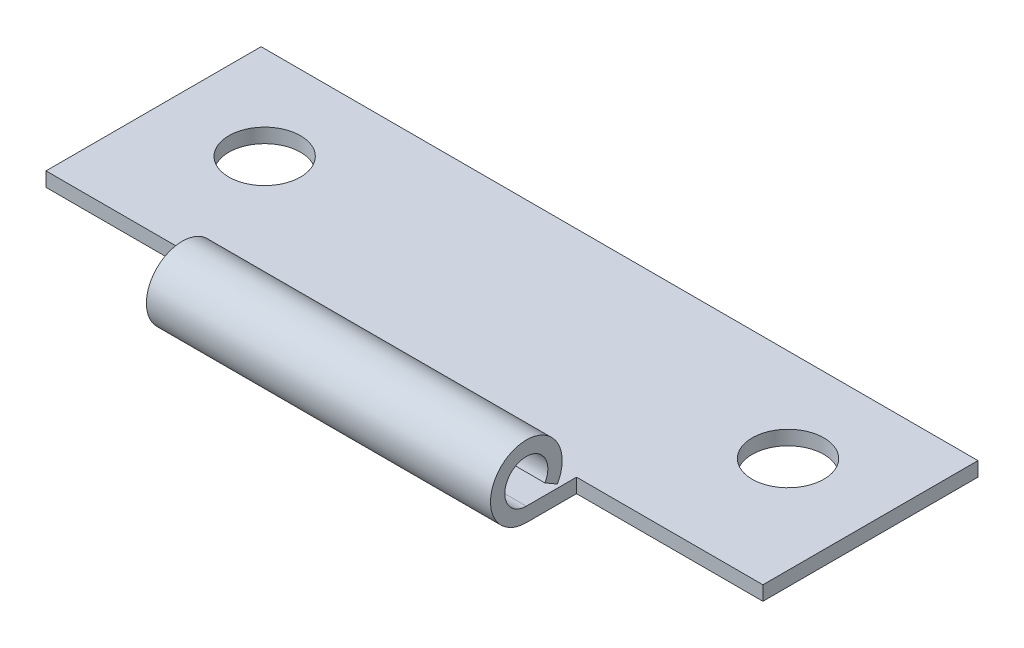
ISO-10303-21;
HEADER;
FILE_DESCRIPTION(('STEP AP214'),'2;1');
FILE_NAME('part.step','',(''),(''),'','','');
FILE_SCHEMA(('AUTOMOTIVE_DESIGN { 1 0 10303 214 1 1 1 1 }'));
ENDSEC;
DATA;
#1=APPLICATION_CONTEXT('core data for automotive mechanical design processes');
#2=APPLICATION_PROTOCOL_DEFINITION('international standard','automotive_design',2000,#1);
#3=PRODUCT_CONTEXT('',#1,'mechanical');
#4=PRODUCT('Part','Part','',(#3));
#5=PRODUCT_RELATED_PRODUCT_CATEGORY('part','',(#4));
#6=PRODUCT_DEFINITION_FORMATION('','',#4);
#7=PRODUCT_DEFINITION_CONTEXT('part definition',#1,'design');
#8=PRODUCT_DEFINITION('design','',#6,#7);
#9=PRODUCT_DEFINITION_SHAPE('','',#8);
#10=(LENGTH_UNIT() NAMED_UNIT(*) SI_UNIT(.MILLI.,.METRE.));
#11=(NAMED_UNIT(*) PLANE_ANGLE_UNIT() SI_UNIT($,.RADIAN.));
#12=(NAMED_UNIT(*) SI_UNIT($,.STERADIAN.) SOLID_ANGLE_UNIT());
#13=UNCERTAINTY_MEASURE_WITH_UNIT(LENGTH_MEASURE(1.E-05),#10,'distance_accuracy_value','');
#14=(GEOMETRIC_REPRESENTATION_CONTEXT(3) GLOBAL_UNCERTAINTY_ASSIGNED_CONTEXT((#13)) GLOBAL_UNIT_ASSIGNED_CONTEXT((#10,
#11,#12)) REPRESENTATION_CONTEXT('',''));
#15=CARTESIAN_POINT('',(0.,0.,0.));
#16=DIRECTION('',(0.,0.,1.));
#17=DIRECTION('',(1.,0.,0.));
#18=AXIS2_PLACEMENT_3D('',#15,#16,#17);
#19=CARTESIAN_POINT('',(25.,-1.,-10.5));
#20=DIRECTION('',(1.,0.,0.));
#21=DIRECTION('',(0.,0.,-1.));
#22=AXIS2_PLACEMENT_3D('',#19,#20,#21);
#23=PLANE('',#22);
#24=DIRECTION('',(0.,1.,0.));
#25=VECTOR('',#24,1.);
#26=CARTESIAN_POINT('',(25.,-1.,4.49999999999999));
#27=LINE('',#26,#25);
#28=CARTESIAN_POINT('',(25.,-1.,4.49999999999999));
#29=VERTEX_POINT('',#28);
#30=CARTESIAN_POINT('',(25.,0.,4.49999999999999));
#31=VERTEX_POINT('',#30);
#32=EDGE_CURVE('E154',#29,#31,#27,.T.);
#33=ORIENTED_EDGE('',*,*,#32,.F.);
#34=DIRECTION('',(0.,0.,-1.));
#35=VECTOR('',#34,1.);
#36=CARTESIAN_POINT('',(25.,-1.,-10.5));
#37=LINE('',#36,#35);
#38=CARTESIAN_POINT('',(25.,-1.,-10.5));
#39=VERTEX_POINT('',#38);
#40=EDGE_CURVE('E173',#29,#39,#37,.T.);
#41=ORIENTED_EDGE('',*,*,#40,.T.);
#42=DIRECTION('',(0.,1.,0.));
#43=VECTOR('',#42,1.);
#44=CARTESIAN_POINT('',(25.,-1.,-10.5));
#45=LINE('',#44,#43);
#46=CARTESIAN_POINT('',(25.,0.,-10.5));
#47=VERTEX_POINT('',#46);
#48=EDGE_CURVE('E181',#39,#47,#45,.T.);
#49=ORIENTED_EDGE('',*,*,#48,.T.);
#50=DIRECTION('',(0.,0.,-1.));
#51=VECTOR('',#50,1.);
#52=CARTESIAN_POINT('',(25.,0.,-10.5));
#53=LINE('',#52,#51);
#54=EDGE_CURVE('E166',#31,#47,#53,.T.);
#55=ORIENTED_EDGE('',*,*,#54,.F.);
#56=EDGE_LOOP('',(#33,#41,#49,#55));
#57=FACE_BOUND('',#56,.T.);
#58=ADVANCED_FACE('F37',(#57),#23,.T.);
#59=CARTESIAN_POINT('',(-25.,-1.,-10.5));
#60=DIRECTION('',(-1.,0.,0.));
#61=DIRECTION('',(0.,0.,1.));
#62=AXIS2_PLACEMENT_3D('',#59,#60,#61);
#63=PLANE('',#62);
#64=DIRECTION('',(0.,1.,0.));
#65=VECTOR('',#64,1.);
#66=CARTESIAN_POINT('',(-25.,-1.,4.5));
#67=LINE('',#66,#65);
#68=CARTESIAN_POINT('',(-25.,-1.,4.5));
#69=VERTEX_POINT('',#68);
#70=CARTESIAN_POINT('',(-25.,0.,4.5));
#71=VERTEX_POINT('',#70);
#72=EDGE_CURVE('E122',#69,#71,#67,.T.);
#73=ORIENTED_EDGE('',*,*,#72,.T.);
#74=DIRECTION('',(0.,0.,1.));
#75=VECTOR('',#74,1.);
#76=CARTESIAN_POINT('',(-25.,0.,-10.5));
#77=LINE('',#76,#75);
#78=CARTESIAN_POINT('',(-25.,0.,-10.5));
#79=VERTEX_POINT('',#78);
#80=EDGE_CURVE('E176',#79,#71,#77,.T.);
#81=ORIENTED_EDGE('',*,*,#80,.F.);
#82=DIRECTION('',(0.,1.,0.));
#83=VECTOR('',#82,1.);
#84=CARTESIAN_POINT('',(-25.,-1.,-10.5));
#85=LINE('',#84,#83);
#86=CARTESIAN_POINT('',(-25.,-1.,-10.5));
#87=VERTEX_POINT('',#86);
#88=EDGE_CURVE('E188',#87,#79,#85,.T.);
#89=ORIENTED_EDGE('',*,*,#88,.F.);
#90=DIRECTION('',(0.,0.,1.));
#91=VECTOR('',#90,1.);
#92=CARTESIAN_POINT('',(-25.,-1.,-10.5));
#93=LINE('',#92,#91);
#94=EDGE_CURVE('E179',#87,#69,#93,.T.);
#95=ORIENTED_EDGE('',*,*,#94,.T.);
#96=EDGE_LOOP('',(#73,#81,#89,#95));
#97=FACE_BOUND('',#96,.T.);
#98=ADVANCED_FACE('F211',(#97),#63,.T.);
#99=CARTESIAN_POINT('',(-25.,-1.,-10.5));
#100=DIRECTION('',(0.,0.,-1.));
#101=DIRECTION('',(-1.,0.,0.));
#102=AXIS2_PLACEMENT_3D('',#99,#100,#101);
#103=PLANE('',#102);
#104=DIRECTION('',(-1.,0.,0.));
#105=VECTOR('',#104,1.);
#106=CARTESIAN_POINT('',(-25.,0.,-10.5));
#107=LINE('',#106,#105);
#108=EDGE_CURVE('E183',#47,#79,#107,.T.);
#109=ORIENTED_EDGE('',*,*,#108,.F.);
#110=ORIENTED_EDGE('',*,*,#48,.F.);
#111=DIRECTION('',(-1.,0.,0.));
#112=VECTOR('',#111,1.);
#113=CARTESIAN_POINT('',(-25.,-1.,-10.5));
#114=LINE('',#113,#112);
#115=EDGE_CURVE('E175',#39,#87,#114,.T.);
#116=ORIENTED_EDGE('',*,*,#115,.T.);
#117=ORIENTED_EDGE('',*,*,#88,.T.);
#118=EDGE_LOOP('',(#109,#110,#116,#117));
#119=FACE_BOUND('',#118,.T.);
#120=ADVANCED_FACE('F217',(#119),#103,.T.);
#121=CARTESIAN_POINT('',(25.,-1.,10.5));
#122=DIRECTION('',(0.,1.,0.));
#123=DIRECTION('',(0.,0.,1.));
#124=AXIS2_PLACEMENT_3D('',#121,#122,#123);
#125=PLANE('',#124);
#126=CARTESIAN_POINT('',(-18.25,-1.,-4.));
#127=DIRECTION('',(0.,1.,0.));
#128=DIRECTION('',(0.,0.,1.));
#129=AXIS2_PLACEMENT_3D('',#126,#127,#128);
#130=CIRCLE('',#129,2.5);
#131=CARTESIAN_POINT('',(-18.25,-1.,-1.5));
#132=VERTEX_POINT('',#131);
#133=EDGE_CURVE('E372',#132,#132,#130,.T.);
#134=ORIENTED_EDGE('',*,*,#133,.T.);
#135=EDGE_LOOP('',(#134));
#136=FACE_BOUND('',#135,.T.);
#137=CARTESIAN_POINT('',(18.25,-1.,-4.));
#138=DIRECTION('',(0.,1.,0.));
#139=DIRECTION('',(0.,0.,1.));
#140=AXIS2_PLACEMENT_3D('',#137,#138,#139);
#141=CIRCLE('',#140,2.5);
#142=CARTESIAN_POINT('',(18.25,-1.,-1.5));
#143=VERTEX_POINT('',#142);
#144=EDGE_CURVE('E137',#143,#143,#141,.T.);
#145=ORIENTED_EDGE('',*,*,#144,.T.);
#146=EDGE_LOOP('',(#145));
#147=FACE_BOUND('',#146,.T.);
#148=DIRECTION('',(1.,0.,0.));
#149=VECTOR('',#148,1.);
#150=CARTESIAN_POINT('',(25.,-1.,8.));
#151=LINE('',#150,#149);
#152=CARTESIAN_POINT('',(12.,-1.,8.));
#153=VERTEX_POINT('',#152);
#154=CARTESIAN_POINT('',(-12.,-1.,8.));
#155=VERTEX_POINT('',#154);
#156=EDGE_CURVE('E136',#153,#155,#151,.F.);
#157=ORIENTED_EDGE('',*,*,#156,.T.);
#158=DIRECTION('',(0.,0.,-1.));
#159=VECTOR('',#158,1.);
#160=CARTESIAN_POINT('',(-12.,-1.,4.5));
#161=LINE('',#160,#159);
#162=CARTESIAN_POINT('',(-12.,-1.,4.5));
#163=VERTEX_POINT('',#162);
#164=EDGE_CURVE('E116',#155,#163,#161,.T.);
#165=ORIENTED_EDGE('',*,*,#164,.T.);
#166=DIRECTION('',(-1.,0.,0.));
#167=VECTOR('',#166,1.);
#168=CARTESIAN_POINT('',(-12.,-1.,4.5));
#169=LINE('',#168,#167);
#170=EDGE_CURVE('E123',#163,#69,#169,.T.);
#171=ORIENTED_EDGE('',*,*,#170,.T.);
#172=ORIENTED_EDGE('',*,*,#94,.F.);
#173=ORIENTED_EDGE('',*,*,#115,.F.);
#174=ORIENTED_EDGE('',*,*,#40,.F.);
#175=DIRECTION('',(-1.,0.,0.));
#176=VECTOR('',#175,1.);
#177=CARTESIAN_POINT('',(25.,-1.,4.49999999999999));
#178=LINE('',#177,#176);
#179=CARTESIAN_POINT('',(12.,-1.,4.49999999999999));
#180=VERTEX_POINT('',#179);
#181=EDGE_CURVE('E149',#29,#180,#178,.T.);
#182=ORIENTED_EDGE('',*,*,#181,.T.);
#183=DIRECTION('',(0.,0.,1.));
#184=VECTOR('',#183,1.);
#185=CARTESIAN_POINT('',(12.,-1.,4.49999999999999));
#186=LINE('',#185,#184);
#187=EDGE_CURVE('E152',#180,#153,#186,.T.);
#188=ORIENTED_EDGE('',*,*,#187,.T.);
#189=EDGE_LOOP('',(#157,#165,#171,#172,#173,#174,#182,#188));
#190=FACE_BOUND('',#189,.T.);
#191=ADVANCED_FACE('F133',(#136,#147,#190),#125,.F.);
#192=CARTESIAN_POINT('',(25.,0.,10.5));
#193=DIRECTION('',(0.,1.,0.));
#194=DIRECTION('',(0.,0.,1.));
#195=AXIS2_PLACEMENT_3D('',#192,#193,#194);
#196=PLANE('',#195);
#197=CARTESIAN_POINT('',(-18.25,0.,-4.));
#198=DIRECTION('',(0.,1.,0.));
#199=DIRECTION('',(0.,0.,1.));
#200=AXIS2_PLACEMENT_3D('',#197,#198,#199);
#201=CIRCLE('',#200,2.5);
#202=CARTESIAN_POINT('',(-18.25,0.,-1.5));
#203=VERTEX_POINT('',#202);
#204=EDGE_CURVE('E375',#203,#203,#201,.T.);
#205=ORIENTED_EDGE('',*,*,#204,.F.);
#206=EDGE_LOOP('',(#205));
#207=FACE_BOUND('',#206,.T.);
#208=CARTESIAN_POINT('',(18.25,0.,-4.));
#209=DIRECTION('',(0.,1.,0.));
#210=DIRECTION('',(0.,0.,1.));
#211=AXIS2_PLACEMENT_3D('',#208,#209,#210);
#212=CIRCLE('',#211,2.5);
#213=CARTESIAN_POINT('',(18.25,0.,-1.5));
#214=VERTEX_POINT('',#213);
#215=EDGE_CURVE('E140',#214,#214,#212,.T.);
#216=ORIENTED_EDGE('',*,*,#215,.F.);
#217=EDGE_LOOP('',(#216));
#218=FACE_BOUND('',#217,.T.);
#219=DIRECTION('',(0.,0.,-1.));
#220=VECTOR('',#219,1.);
#221=CARTESIAN_POINT('',(-12.,0.,10.5));
#222=LINE('',#221,#220);
#223=CARTESIAN_POINT('',(-12.,0.,8.));
#224=VERTEX_POINT('',#223);
#225=CARTESIAN_POINT('',(-12.,0.,4.5));
#226=VERTEX_POINT('',#225);
#227=EDGE_CURVE('E119',#224,#226,#222,.T.);
#228=ORIENTED_EDGE('',*,*,#227,.F.);
#229=DIRECTION('',(1.,0.,0.));
#230=VECTOR('',#229,1.);
#231=CARTESIAN_POINT('',(25.,0.,8.));
#232=LINE('',#231,#230);
#233=CARTESIAN_POINT('',(12.,0.,8.));
#234=VERTEX_POINT('',#233);
#235=EDGE_CURVE('E169',#234,#224,#232,.F.);
#236=ORIENTED_EDGE('',*,*,#235,.F.);
#237=DIRECTION('',(0.,0.,1.));
#238=VECTOR('',#237,1.);
#239=CARTESIAN_POINT('',(12.,0.,10.5));
#240=LINE('',#239,#238);
#241=CARTESIAN_POINT('',(12.,0.,4.49999999999999));
#242=VERTEX_POINT('',#241);
#243=EDGE_CURVE('E59',#242,#234,#240,.T.);
#244=ORIENTED_EDGE('',*,*,#243,.F.);
#245=DIRECTION('',(-1.,0.,0.));
#246=VECTOR('',#245,1.);
#247=CARTESIAN_POINT('',(25.,0.,4.49999999999999));
#248=LINE('',#247,#246);
#249=EDGE_CURVE('E194',#31,#242,#248,.T.);
#250=ORIENTED_EDGE('',*,*,#249,.F.);
#251=ORIENTED_EDGE('',*,*,#54,.T.);
#252=ORIENTED_EDGE('',*,*,#108,.T.);
#253=ORIENTED_EDGE('',*,*,#80,.T.);
#254=DIRECTION('',(-1.,0.,0.));
#255=VECTOR('',#254,1.);
#256=CARTESIAN_POINT('',(25.,0.,4.49999999999999));
#257=LINE('',#256,#255);
#258=EDGE_CURVE('E11',#226,#71,#257,.T.);
#259=ORIENTED_EDGE('',*,*,#258,.F.);
#260=EDGE_LOOP('',(#228,#236,#244,#250,#251,#252,#253,#259));
#261=FACE_BOUND('',#260,.T.);
#262=ADVANCED_FACE('F207',(#207,#218,#261),#196,.T.);
#263=CARTESIAN_POINT('',(0.,0.749999999999984,6.70096189432335));
#264=DIRECTION('',(0.,0.866025403784433,-0.50000000000001));
#265=DIRECTION('',(1.,0.,0.));
#266=AXIS2_PLACEMENT_3D('',#263,#264,#265);
#267=PLANE('',#266);
#268=DIRECTION('',(0.,-0.50000000000001,-0.866025403784433));
#269=VECTOR('',#268,1.);
#270=CARTESIAN_POINT('',(-12.,0.749999999999983,6.70096189432335));
#271=LINE('',#270,#269);
#272=CARTESIAN_POINT('',(-12.,0.249999999999975,5.83493649053892));
#273=VERTEX_POINT('',#272);
#274=CARTESIAN_POINT('',(-12.,0.749999999999985,6.70096189432335));
#275=VERTEX_POINT('',#274);
#276=EDGE_CURVE('E51',#273,#275,#271,.F.);
#277=ORIENTED_EDGE('',*,*,#276,.F.);
#278=DIRECTION('',(1.,0.,0.));
#279=VECTOR('',#278,1.);
#280=CARTESIAN_POINT('',(25.,0.249999999999972,5.83493649053892));
#281=LINE('',#280,#279);
#282=CARTESIAN_POINT('',(12.,0.249999999999974,5.83493649053892));
#283=VERTEX_POINT('',#282);
#284=EDGE_CURVE('E167',#273,#283,#281,.T.);
#285=ORIENTED_EDGE('',*,*,#284,.T.);
#286=DIRECTION('',(0.,0.50000000000001,0.866025403784433));
#287=VECTOR('',#286,1.);
#288=CARTESIAN_POINT('',(12.,0.749999999999985,6.70096189432335));
#289=LINE('',#288,#287);
#290=CARTESIAN_POINT('',(12.,0.749999999999984,6.70096189432335));
#291=VERTEX_POINT('',#290);
#292=EDGE_CURVE('E157',#291,#283,#289,.F.);
#293=ORIENTED_EDGE('',*,*,#292,.F.);
#294=DIRECTION('',(1.,0.,0.));
#295=VECTOR('',#294,1.);
#296=CARTESIAN_POINT('',(25.,0.749999999999982,6.70096189432335));
#297=LINE('',#296,#295);
#298=EDGE_CURVE('E164',#275,#291,#297,.T.);
#299=ORIENTED_EDGE('',*,*,#298,.F.);
#300=EDGE_LOOP('',(#277,#285,#293,#299));
#301=FACE_BOUND('',#300,.T.);
#302=ADVANCED_FACE('F201',(#301),#267,.F.);
#303=CARTESIAN_POINT('',(25.,1.5,8.));
#304=DIRECTION('',(1.,0.,0.));
#305=DIRECTION('',(0.,-0.50000000000001,-0.866025403784433));
#306=AXIS2_PLACEMENT_3D('',#303,#304,#305);
#307=CYLINDRICAL_SURFACE('',#306,2.5);
#308=CARTESIAN_POINT('',(-12.,1.5,8.));
#309=DIRECTION('',(1.,0.,0.));
#310=DIRECTION('',(0.,0.,-1.));
#311=AXIS2_PLACEMENT_3D('',#308,#309,#310);
#312=CIRCLE('',#311,2.5);
#313=EDGE_CURVE('E147',#155,#273,#312,.F.);
#314=ORIENTED_EDGE('',*,*,#313,.F.);
#315=ORIENTED_EDGE('',*,*,#156,.F.);
#316=CARTESIAN_POINT('',(12.,1.5,8.));
#317=DIRECTION('',(-1.,0.,0.));
#318=DIRECTION('',(0.,0.,1.));
#319=AXIS2_PLACEMENT_3D('',#316,#317,#318);
#320=CIRCLE('',#319,2.5);
#321=EDGE_CURVE('E162',#283,#153,#320,.F.);
#322=ORIENTED_EDGE('',*,*,#321,.F.);
#323=ORIENTED_EDGE('',*,*,#284,.F.);
#324=EDGE_LOOP('',(#314,#315,#322,#323));
#325=FACE_BOUND('',#324,.T.);
#326=ADVANCED_FACE('F249',(#325),#307,.T.);
#327=CARTESIAN_POINT('',(25.,1.5,8.));
#328=DIRECTION('',(1.,0.,0.));
#329=DIRECTION('',(0.,-0.50000000000001,-0.866025403784433));
#330=AXIS2_PLACEMENT_3D('',#327,#328,#329);
#331=CYLINDRICAL_SURFACE('',#330,1.5);
#332=ORIENTED_EDGE('',*,*,#235,.T.);
#333=CARTESIAN_POINT('',(-12.,1.5,8.));
#334=DIRECTION('',(1.,0.,0.));
#335=DIRECTION('',(0.,0.,-1.));
#336=AXIS2_PLACEMENT_3D('',#333,#334,#335);
#337=CIRCLE('',#336,1.5);
#338=EDGE_CURVE('E44',#224,#275,#337,.F.);
#339=ORIENTED_EDGE('',*,*,#338,.T.);
#340=ORIENTED_EDGE('',*,*,#298,.T.);
#341=CARTESIAN_POINT('',(12.,1.5,8.));
#342=DIRECTION('',(-1.,0.,0.));
#343=DIRECTION('',(0.,0.,1.));
#344=AXIS2_PLACEMENT_3D('',#341,#342,#343);
#345=CIRCLE('',#344,1.5);
#346=EDGE_CURVE('E190',#291,#234,#345,.F.);
#347=ORIENTED_EDGE('',*,*,#346,.T.);
#348=EDGE_LOOP('',(#332,#339,#340,#347));
#349=FACE_BOUND('',#348,.T.);
#350=ADVANCED_FACE('F197',(#349),#331,.F.);
#351=CARTESIAN_POINT('',(12.,-1.,4.49999999999999));
#352=DIRECTION('',(-1.,0.,0.));
#353=DIRECTION('',(0.,0.,1.));
#354=AXIS2_PLACEMENT_3D('',#351,#352,#353);
#355=PLANE('',#354);
#356=ORIENTED_EDGE('',*,*,#321,.T.);
#357=ORIENTED_EDGE('',*,*,#187,.F.);
#358=DIRECTION('',(0.,1.,0.));
#359=VECTOR('',#358,1.);
#360=CARTESIAN_POINT('',(12.,-1.,4.49999999999999));
#361=LINE('',#360,#359);
#362=EDGE_CURVE('E155',#180,#242,#361,.T.);
#363=ORIENTED_EDGE('',*,*,#362,.T.);
#364=ORIENTED_EDGE('',*,*,#243,.T.);
#365=ORIENTED_EDGE('',*,*,#346,.F.);
#366=ORIENTED_EDGE('',*,*,#292,.T.);
#367=EDGE_LOOP('',(#356,#357,#363,#364,#365,#366));
#368=FACE_BOUND('',#367,.T.);
#369=ADVANCED_FACE('F204',(#368),#355,.F.);
#370=CARTESIAN_POINT('',(25.,-1.,4.49999999999999));
#371=DIRECTION('',(0.,0.,-1.));
#372=DIRECTION('',(-1.,0.,0.));
#373=AXIS2_PLACEMENT_3D('',#370,#371,#372);
#374=PLANE('',#373);
#375=ORIENTED_EDGE('',*,*,#249,.T.);
#376=ORIENTED_EDGE('',*,*,#362,.F.);
#377=ORIENTED_EDGE('',*,*,#181,.F.);
#378=ORIENTED_EDGE('',*,*,#32,.T.);
#379=EDGE_LOOP('',(#375,#376,#377,#378));
#380=FACE_BOUND('',#379,.T.);
#381=ADVANCED_FACE('F222',(#380),#374,.F.);
#382=CARTESIAN_POINT('',(-12.,-1.,4.5));
#383=DIRECTION('',(1.,0.,0.));
#384=DIRECTION('',(0.,0.,-1.));
#385=AXIS2_PLACEMENT_3D('',#382,#383,#384);
#386=PLANE('',#385);
#387=ORIENTED_EDGE('',*,*,#313,.T.);
#388=ORIENTED_EDGE('',*,*,#276,.T.);
#389=ORIENTED_EDGE('',*,*,#338,.F.);
#390=ORIENTED_EDGE('',*,*,#227,.T.);
#391=DIRECTION('',(0.,1.,0.));
#392=VECTOR('',#391,1.);
#393=CARTESIAN_POINT('',(-12.,-1.,4.5));
#394=LINE('',#393,#392);
#395=EDGE_CURVE('E112',#163,#226,#394,.T.);
#396=ORIENTED_EDGE('',*,*,#395,.F.);
#397=ORIENTED_EDGE('',*,*,#164,.F.);
#398=EDGE_LOOP('',(#387,#388,#389,#390,#396,#397));
#399=FACE_BOUND('',#398,.T.);
#400=ADVANCED_FACE('F114',(#399),#386,.F.);
#401=CARTESIAN_POINT('',(-12.,-1.,4.5));
#402=DIRECTION('',(0.,0.,-1.));
#403=DIRECTION('',(-1.,0.,0.));
#404=AXIS2_PLACEMENT_3D('',#401,#402,#403);
#405=PLANE('',#404);
#406=ORIENTED_EDGE('',*,*,#258,.T.);
#407=ORIENTED_EDGE('',*,*,#72,.F.);
#408=ORIENTED_EDGE('',*,*,#170,.F.);
#409=ORIENTED_EDGE('',*,*,#395,.T.);
#410=EDGE_LOOP('',(#406,#407,#408,#409));
#411=FACE_BOUND('',#410,.T.);
#412=ADVANCED_FACE('F126',(#411),#405,.F.);
#413=CARTESIAN_POINT('',(18.25,-1.,-4.));
#414=DIRECTION('',(0.,1.,0.));
#415=DIRECTION('',(0.,0.,1.));
#416=AXIS2_PLACEMENT_3D('',#413,#414,#415);
#417=CYLINDRICAL_SURFACE('',#416,2.5);
#418=ORIENTED_EDGE('',*,*,#144,.F.);
#419=EDGE_LOOP('',(#418));
#420=FACE_BOUND('',#419,.T.);
#421=ORIENTED_EDGE('',*,*,#215,.T.);
#422=EDGE_LOOP('',(#421));
#423=FACE_BOUND('',#422,.T.);
#424=ADVANCED_FACE('F287',(#420,#423),#417,.F.);
#425=CARTESIAN_POINT('',(-18.25,-1.,-4.));
#426=DIRECTION('',(0.,1.,0.));
#427=DIRECTION('',(0.,0.,1.));
#428=AXIS2_PLACEMENT_3D('',#425,#426,#427);
#429=CYLINDRICAL_SURFACE('',#428,2.5);
#430=ORIENTED_EDGE('',*,*,#133,.F.);
#431=EDGE_LOOP('',(#430));
#432=FACE_BOUND('',#431,.T.);
#433=ORIENTED_EDGE('',*,*,#204,.T.);
#434=EDGE_LOOP('',(#433));
#435=FACE_BOUND('',#434,.T.);
#436=ADVANCED_FACE('F305',(#432,#435),#429,.F.);
#437=CLOSED_SHELL('',(#58,#98,#120,#191,#262,#302,#326,#350,#369,#381,#400,#412,#424,#436));
#438=MANIFOLD_SOLID_BREP('B2',#437);
#439=ADVANCED_BREP_SHAPE_REPRESENTATION('',(#18,#438),#14);
#440=SHAPE_DEFINITION_REPRESENTATION(#9,#439);
ENDSEC;
END-ISO-10303-21;
